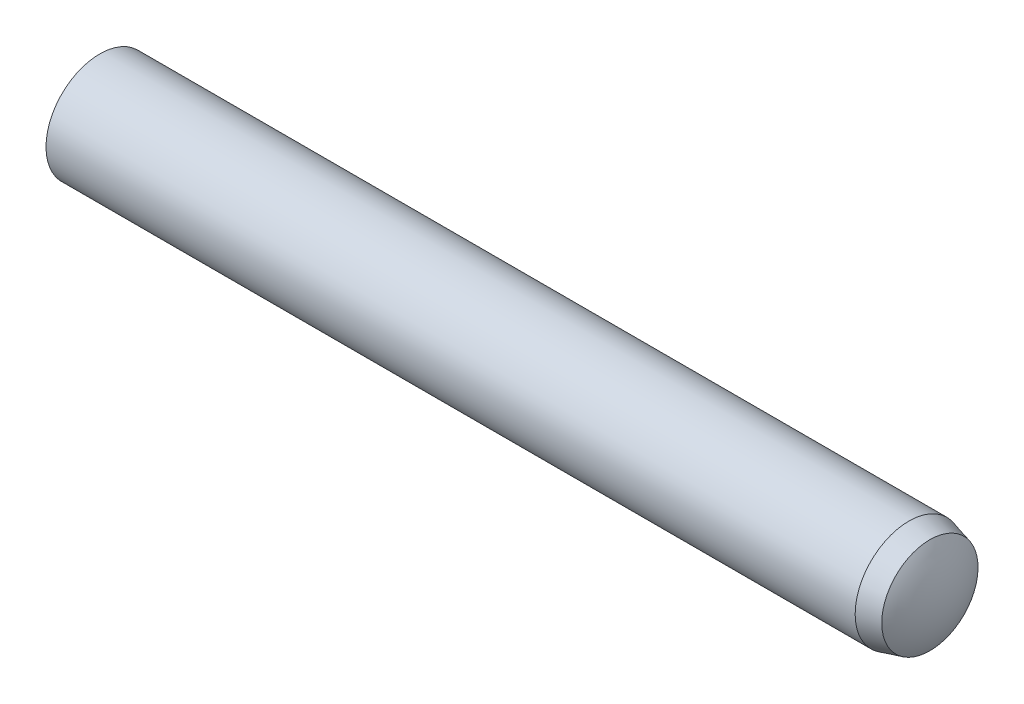
ISO-10303-21;
HEADER;
FILE_DESCRIPTION(('STEP AP214'),'2;1');
FILE_NAME('part.step','',(''),(''),'','','');
FILE_SCHEMA(('AUTOMOTIVE_DESIGN { 1 0 10303 214 1 1 1 1 }'));
ENDSEC;
DATA;
#1=APPLICATION_CONTEXT('core data for automotive mechanical design processes');
#2=APPLICATION_PROTOCOL_DEFINITION('international standard','automotive_design',2000,#1);
#3=PRODUCT_CONTEXT('',#1,'mechanical');
#4=PRODUCT('Part','Part','',(#3));
#5=PRODUCT_RELATED_PRODUCT_CATEGORY('part','',(#4));
#6=PRODUCT_DEFINITION_FORMATION('','',#4);
#7=PRODUCT_DEFINITION_CONTEXT('part definition',#1,'design');
#8=PRODUCT_DEFINITION('design','',#6,#7);
#9=PRODUCT_DEFINITION_SHAPE('','',#8);
#10=(LENGTH_UNIT() NAMED_UNIT(*) SI_UNIT(.MILLI.,.METRE.));
#11=(NAMED_UNIT(*) PLANE_ANGLE_UNIT() SI_UNIT($,.RADIAN.));
#12=(NAMED_UNIT(*) SI_UNIT($,.STERADIAN.) SOLID_ANGLE_UNIT());
#13=UNCERTAINTY_MEASURE_WITH_UNIT(LENGTH_MEASURE(1.E-05),#10,'distance_accuracy_value','');
#14=(GEOMETRIC_REPRESENTATION_CONTEXT(3) GLOBAL_UNCERTAINTY_ASSIGNED_CONTEXT((#13)) GLOBAL_UNIT_ASSIGNED_CONTEXT((#10,
#11,#12)) REPRESENTATION_CONTEXT('',''));
#15=CARTESIAN_POINT('',(0.,0.,0.));
#16=DIRECTION('',(0.,0.,1.));
#17=DIRECTION('',(1.,0.,0.));
#18=AXIS2_PLACEMENT_3D('',#15,#16,#17);
#19=CARTESIAN_POINT('',(-12.,0.,0.));
#20=DIRECTION('',(1.,0.,0.));
#21=DIRECTION('',(0.,0.,-1.));
#22=AXIS2_PLACEMENT_3D('',#19,#20,#21);
#23=CYLINDRICAL_SURFACE('',#22,1.5);
#24=CARTESIAN_POINT('',(11.025,0.,0.));
#25=DIRECTION('',(-1.,0.,0.));
#26=DIRECTION('',(0.,0.,1.));
#27=AXIS2_PLACEMENT_3D('',#24,#25,#26);
#28=CIRCLE('',#27,1.49999999999999);
#29=CARTESIAN_POINT('',(11.025,0.,1.49999999999999));
#30=VERTEX_POINT('',#29);
#31=EDGE_CURVE('E11',#30,#30,#28,.T.);
#32=ORIENTED_EDGE('',*,*,#31,.T.);
#33=EDGE_LOOP('',(#32));
#34=FACE_BOUND('',#33,.T.);
#35=CARTESIAN_POINT('',(-11.55,0.,0.));
#36=DIRECTION('',(-1.,0.,0.));
#37=DIRECTION('',(0.,0.,1.));
#38=AXIS2_PLACEMENT_3D('',#35,#36,#37);
#39=CIRCLE('',#38,1.5);
#40=CARTESIAN_POINT('',(-11.55,0.,1.5));
#41=VERTEX_POINT('',#40);
#42=EDGE_CURVE('E37',#41,#41,#39,.T.);
#43=ORIENTED_EDGE('',*,*,#42,.F.);
#44=EDGE_LOOP('',(#43));
#45=FACE_BOUND('',#44,.T.);
#46=ADVANCED_FACE('F17',(#34,#45),#23,.T.);
#47=CARTESIAN_POINT('',(11.025,0.,0.));
#48=DIRECTION('',(-1.,0.,0.));
#49=DIRECTION('',(0.,0.,1.));
#50=AXIS2_PLACEMENT_3D('',#47,#48,#49);
#51=CONICAL_SURFACE('',#50,1.49999999999999,0.261799387799151);
#52=CARTESIAN_POINT('',(11.61,0.,0.));
#53=DIRECTION('',(-1.,0.,0.));
#54=DIRECTION('',(0.,0.,1.));
#55=AXIS2_PLACEMENT_3D('',#52,#53,#54);
#56=CIRCLE('',#55,1.34324972242779);
#57=CARTESIAN_POINT('',(11.61,0.,1.34324972242779));
#58=VERTEX_POINT('',#57);
#59=EDGE_CURVE('E24',#58,#58,#56,.T.);
#60=ORIENTED_EDGE('',*,*,#59,.T.);
#61=EDGE_LOOP('',(#60));
#62=FACE_BOUND('',#61,.T.);
#63=ORIENTED_EDGE('',*,*,#31,.F.);
#64=EDGE_LOOP('',(#63));
#65=FACE_BOUND('',#64,.T.);
#66=ADVANCED_FACE('F43',(#62,#65),#51,.T.);
#67=CARTESIAN_POINT('',(9.49176946563807,0.,0.));
#68=DIRECTION('',(-1.,0.,0.));
#69=DIRECTION('',(0.,1.,0.));
#70=AXIS2_PLACEMENT_3D('',#67,#68,#69);
#71=SPHERICAL_SURFACE('',#70,2.50823053436192);
#72=CARTESIAN_POINT('',(12.,0.,0.));
#73=VERTEX_POINT('',#72);
#74=VERTEX_LOOP('',#73);
#75=FACE_BOUND('',#74,.T.);
#76=ORIENTED_EDGE('',*,*,#59,.F.);
#77=EDGE_LOOP('',(#76));
#78=FACE_BOUND('',#77,.T.);
#79=ADVANCED_FACE('F33',(#75,#78),#71,.T.);
#80=CARTESIAN_POINT('',(-9.27500000000001,0.,0.));
#81=DIRECTION('',(-1.,0.,0.));
#82=DIRECTION('',(0.,-1.,0.));
#83=AXIS2_PLACEMENT_3D('',#80,#81,#82);
#84=SPHERICAL_SURFACE('',#83,2.72499999999999);
#85=CARTESIAN_POINT('',(-12.,0.,0.));
#86=VERTEX_POINT('',#85);
#87=VERTEX_LOOP('',#86);
#88=FACE_BOUND('',#87,.T.);
#89=ORIENTED_EDGE('',*,*,#42,.T.);
#90=EDGE_LOOP('',(#89));
#91=FACE_BOUND('',#90,.T.);
#92=ADVANCED_FACE('F30',(#88,#91),#84,.T.);
#93=CLOSED_SHELL('',(#46,#66,#79,#92));
#94=MANIFOLD_SOLID_BREP('B1',#93);
#95=ADVANCED_BREP_SHAPE_REPRESENTATION('',(#18,#94),#14);
#96=SHAPE_DEFINITION_REPRESENTATION(#9,#95);
ENDSEC;
END-ISO-10303-21;
